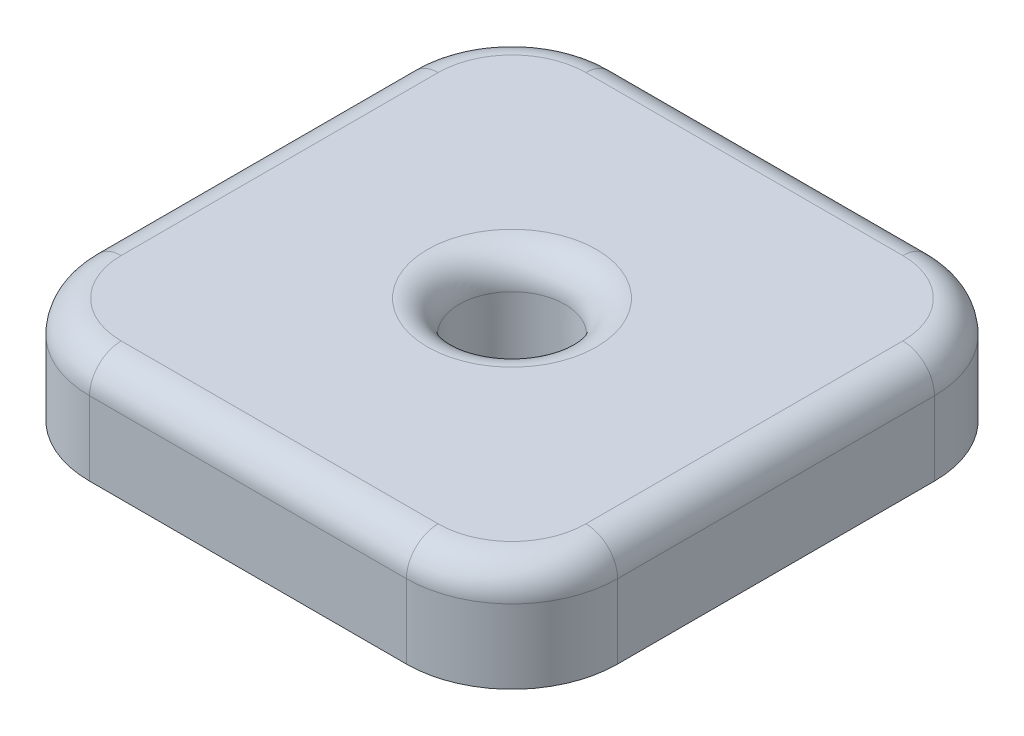
ISO-10303-21;
HEADER;
FILE_DESCRIPTION(('STEP AP214'),'2;1');
FILE_NAME('part.step','',(''),(''),'','','');
FILE_SCHEMA(('AUTOMOTIVE_DESIGN { 1 0 10303 214 1 1 1 1 }'));
ENDSEC;
DATA;
#1=APPLICATION_CONTEXT('core data for automotive mechanical design processes');
#2=APPLICATION_PROTOCOL_DEFINITION('international standard','automotive_design',2000,#1);
#3=PRODUCT_CONTEXT('',#1,'mechanical');
#4=PRODUCT('Part','Part','',(#3));
#5=PRODUCT_RELATED_PRODUCT_CATEGORY('part','',(#4));
#6=PRODUCT_DEFINITION_FORMATION('','',#4);
#7=PRODUCT_DEFINITION_CONTEXT('part definition',#1,'design');
#8=PRODUCT_DEFINITION('design','',#6,#7);
#9=PRODUCT_DEFINITION_SHAPE('','',#8);
#10=(LENGTH_UNIT() NAMED_UNIT(*) SI_UNIT(.MILLI.,.METRE.));
#11=(NAMED_UNIT(*) PLANE_ANGLE_UNIT() SI_UNIT($,.RADIAN.));
#12=(NAMED_UNIT(*) SI_UNIT($,.STERADIAN.) SOLID_ANGLE_UNIT());
#13=UNCERTAINTY_MEASURE_WITH_UNIT(LENGTH_MEASURE(1.E-05),#10,'distance_accuracy_value','');
#14=(GEOMETRIC_REPRESENTATION_CONTEXT(3) GLOBAL_UNCERTAINTY_ASSIGNED_CONTEXT((#13)) GLOBAL_UNIT_ASSIGNED_CONTEXT((#10,
#11,#12)) REPRESENTATION_CONTEXT('',''));
#15=CARTESIAN_POINT('',(0.,0.,0.));
#16=DIRECTION('',(0.,0.,1.));
#17=DIRECTION('',(1.,0.,0.));
#18=AXIS2_PLACEMENT_3D('',#15,#16,#17);
#19=CARTESIAN_POINT('',(25.,10.,25.));
#20=DIRECTION('',(-1.,0.,0.));
#21=DIRECTION('',(0.,0.,1.));
#22=AXIS2_PLACEMENT_3D('',#19,#20,#21);
#23=PLANE('',#22);
#24=DIRECTION('',(0.,-1.,0.));
#25=VECTOR('',#24,1.);
#26=CARTESIAN_POINT('',(25.,10.,-15.));
#27=LINE('',#26,#25);
#28=CARTESIAN_POINT('',(25.,0.,-15.));
#29=VERTEX_POINT('',#28);
#30=CARTESIAN_POINT('',(25.,7.,-15.));
#31=VERTEX_POINT('',#30);
#32=EDGE_CURVE('E170',#29,#31,#27,.F.);
#33=ORIENTED_EDGE('',*,*,#32,.T.);
#34=DIRECTION('',(0.,0.,-1.));
#35=VECTOR('',#34,1.);
#36=CARTESIAN_POINT('',(25.,7.,25.));
#37=LINE('',#36,#35);
#38=CARTESIAN_POINT('',(25.,7.,15.));
#39=VERTEX_POINT('',#38);
#40=EDGE_CURVE('E200',#31,#39,#37,.F.);
#41=ORIENTED_EDGE('',*,*,#40,.T.);
#42=DIRECTION('',(0.,-1.,0.));
#43=VECTOR('',#42,1.);
#44=CARTESIAN_POINT('',(25.,10.,15.));
#45=LINE('',#44,#43);
#46=CARTESIAN_POINT('',(25.,0.,15.));
#47=VERTEX_POINT('',#46);
#48=EDGE_CURVE('E168',#39,#47,#45,.T.);
#49=ORIENTED_EDGE('',*,*,#48,.T.);
#50=DIRECTION('',(0.,0.,-1.));
#51=VECTOR('',#50,1.);
#52=CARTESIAN_POINT('',(25.,0.,25.));
#53=LINE('',#52,#51);
#54=EDGE_CURVE('E234',#47,#29,#53,.T.);
#55=ORIENTED_EDGE('',*,*,#54,.T.);
#56=EDGE_LOOP('',(#33,#41,#49,#55));
#57=FACE_BOUND('',#56,.T.);
#58=ADVANCED_FACE('F37',(#57),#23,.F.);
#59=CARTESIAN_POINT('',(-25.,10.,-25.));
#60=DIRECTION('',(0.,0.,1.));
#61=DIRECTION('',(1.,0.,0.));
#62=AXIS2_PLACEMENT_3D('',#59,#60,#61);
#63=PLANE('',#62);
#64=DIRECTION('',(0.,-1.,0.));
#65=VECTOR('',#64,1.);
#66=CARTESIAN_POINT('',(-15.,10.,-25.));
#67=LINE('',#66,#65);
#68=CARTESIAN_POINT('',(-15.,0.,-25.));
#69=VERTEX_POINT('',#68);
#70=CARTESIAN_POINT('',(-15.,7.,-25.));
#71=VERTEX_POINT('',#70);
#72=EDGE_CURVE('E165',#69,#71,#67,.F.);
#73=ORIENTED_EDGE('',*,*,#72,.T.);
#74=DIRECTION('',(-1.,0.,0.));
#75=VECTOR('',#74,1.);
#76=CARTESIAN_POINT('',(-25.,7.,-25.));
#77=LINE('',#76,#75);
#78=CARTESIAN_POINT('',(15.,7.,-25.));
#79=VERTEX_POINT('',#78);
#80=EDGE_CURVE('E196',#71,#79,#77,.F.);
#81=ORIENTED_EDGE('',*,*,#80,.T.);
#82=DIRECTION('',(0.,-1.,0.));
#83=VECTOR('',#82,1.);
#84=CARTESIAN_POINT('',(15.,10.,-25.));
#85=LINE('',#84,#83);
#86=CARTESIAN_POINT('',(15.,0.,-25.));
#87=VERTEX_POINT('',#86);
#88=EDGE_CURVE('E163',#79,#87,#85,.T.);
#89=ORIENTED_EDGE('',*,*,#88,.T.);
#90=DIRECTION('',(-1.,0.,0.));
#91=VECTOR('',#90,1.);
#92=CARTESIAN_POINT('',(-25.,0.,-25.));
#93=LINE('',#92,#91);
#94=EDGE_CURVE('E153',#87,#69,#93,.T.);
#95=ORIENTED_EDGE('',*,*,#94,.T.);
#96=EDGE_LOOP('',(#73,#81,#89,#95));
#97=FACE_BOUND('',#96,.T.);
#98=ADVANCED_FACE('F244',(#97),#63,.F.);
#99=CARTESIAN_POINT('',(-25.,10.,25.));
#100=DIRECTION('',(1.,0.,0.));
#101=DIRECTION('',(0.,0.,-1.));
#102=AXIS2_PLACEMENT_3D('',#99,#100,#101);
#103=PLANE('',#102);
#104=DIRECTION('',(0.,-1.,0.));
#105=VECTOR('',#104,1.);
#106=CARTESIAN_POINT('',(-25.,10.,15.));
#107=LINE('',#106,#105);
#108=CARTESIAN_POINT('',(-25.,0.,15.));
#109=VERTEX_POINT('',#108);
#110=CARTESIAN_POINT('',(-25.,7.,15.));
#111=VERTEX_POINT('',#110);
#112=EDGE_CURVE('E140',#109,#111,#107,.F.);
#113=ORIENTED_EDGE('',*,*,#112,.T.);
#114=DIRECTION('',(0.,0.,1.));
#115=VECTOR('',#114,1.);
#116=CARTESIAN_POINT('',(-25.,7.,25.));
#117=LINE('',#116,#115);
#118=CARTESIAN_POINT('',(-25.,7.,-15.));
#119=VERTEX_POINT('',#118);
#120=EDGE_CURVE('E46',#111,#119,#117,.F.);
#121=ORIENTED_EDGE('',*,*,#120,.T.);
#122=DIRECTION('',(0.,-1.,0.));
#123=VECTOR('',#122,1.);
#124=CARTESIAN_POINT('',(-25.,10.,-15.));
#125=LINE('',#124,#123);
#126=CARTESIAN_POINT('',(-25.,0.,-15.));
#127=VERTEX_POINT('',#126);
#128=EDGE_CURVE('E144',#119,#127,#125,.T.);
#129=ORIENTED_EDGE('',*,*,#128,.T.);
#130=DIRECTION('',(0.,0.,1.));
#131=VECTOR('',#130,1.);
#132=CARTESIAN_POINT('',(-25.,0.,25.));
#133=LINE('',#132,#131);
#134=EDGE_CURVE('E150',#127,#109,#133,.T.);
#135=ORIENTED_EDGE('',*,*,#134,.T.);
#136=EDGE_LOOP('',(#113,#121,#129,#135));
#137=FACE_BOUND('',#136,.T.);
#138=ADVANCED_FACE('F304',(#137),#103,.F.);
#139=CARTESIAN_POINT('',(-25.,10.,25.));
#140=DIRECTION('',(0.,0.,-1.));
#141=DIRECTION('',(-1.,0.,0.));
#142=AXIS2_PLACEMENT_3D('',#139,#140,#141);
#143=PLANE('',#142);
#144=DIRECTION('',(0.,-1.,0.));
#145=VECTOR('',#144,1.);
#146=CARTESIAN_POINT('',(15.,10.,25.));
#147=LINE('',#146,#145);
#148=CARTESIAN_POINT('',(15.,0.,25.));
#149=VERTEX_POINT('',#148);
#150=CARTESIAN_POINT('',(15.,7.,25.));
#151=VERTEX_POINT('',#150);
#152=EDGE_CURVE('E136',#149,#151,#147,.F.);
#153=ORIENTED_EDGE('',*,*,#152,.T.);
#154=DIRECTION('',(1.,0.,0.));
#155=VECTOR('',#154,1.);
#156=CARTESIAN_POINT('',(-25.,7.,25.));
#157=LINE('',#156,#155);
#158=CARTESIAN_POINT('',(-15.,7.,25.));
#159=VERTEX_POINT('',#158);
#160=EDGE_CURVE('E62',#151,#159,#157,.F.);
#161=ORIENTED_EDGE('',*,*,#160,.T.);
#162=DIRECTION('',(0.,-1.,0.));
#163=VECTOR('',#162,1.);
#164=CARTESIAN_POINT('',(-15.,10.,25.));
#165=LINE('',#164,#163);
#166=CARTESIAN_POINT('',(-15.,0.,25.));
#167=VERTEX_POINT('',#166);
#168=EDGE_CURVE('E128',#159,#167,#165,.T.);
#169=ORIENTED_EDGE('',*,*,#168,.T.);
#170=DIRECTION('',(1.,0.,0.));
#171=VECTOR('',#170,1.);
#172=CARTESIAN_POINT('',(-25.,0.,25.));
#173=LINE('',#172,#171);
#174=EDGE_CURVE('E132',#167,#149,#173,.T.);
#175=ORIENTED_EDGE('',*,*,#174,.T.);
#176=EDGE_LOOP('',(#153,#161,#169,#175));
#177=FACE_BOUND('',#176,.T.);
#178=ADVANCED_FACE('F130',(#177),#143,.F.);
#179=CARTESIAN_POINT('',(0.,10.,0.));
#180=DIRECTION('',(0.,-1.,0.));
#181=DIRECTION('',(0.,0.,-1.));
#182=AXIS2_PLACEMENT_3D('',#179,#180,#181);
#183=PLANE('',#182);
#184=DIRECTION('',(-1.,0.,0.));
#185=VECTOR('',#184,1.);
#186=CARTESIAN_POINT('',(0.,10.,-22.));
#187=LINE('',#186,#185);
#188=CARTESIAN_POINT('',(15.,10.,-22.));
#189=VERTEX_POINT('',#188);
#190=CARTESIAN_POINT('',(-15.,10.,-22.));
#191=VERTEX_POINT('',#190);
#192=EDGE_CURVE('E188',#189,#191,#187,.T.);
#193=ORIENTED_EDGE('',*,*,#192,.T.);
#194=CARTESIAN_POINT('',(-15.,10.,-15.));
#195=DIRECTION('',(0.,-1.,0.));
#196=DIRECTION('',(0.,0.,-1.));
#197=AXIS2_PLACEMENT_3D('',#194,#195,#196);
#198=CIRCLE('',#197,7.);
#199=CARTESIAN_POINT('',(-22.,10.,-15.));
#200=VERTEX_POINT('',#199);
#201=EDGE_CURVE('E190',#191,#200,#198,.F.);
#202=ORIENTED_EDGE('',*,*,#201,.T.);
#203=DIRECTION('',(0.,0.,1.));
#204=VECTOR('',#203,1.);
#205=CARTESIAN_POINT('',(-22.,10.,0.));
#206=LINE('',#205,#204);
#207=CARTESIAN_POINT('',(-22.,10.,15.));
#208=VERTEX_POINT('',#207);
#209=EDGE_CURVE('E176',#200,#208,#206,.T.);
#210=ORIENTED_EDGE('',*,*,#209,.T.);
#211=CARTESIAN_POINT('',(-15.,10.,15.));
#212=DIRECTION('',(0.,-1.,0.));
#213=DIRECTION('',(0.,0.,-1.));
#214=AXIS2_PLACEMENT_3D('',#211,#212,#213);
#215=CIRCLE('',#214,7.);
#216=CARTESIAN_POINT('',(-15.,10.,22.));
#217=VERTEX_POINT('',#216);
#218=EDGE_CURVE('E178',#208,#217,#215,.F.);
#219=ORIENTED_EDGE('',*,*,#218,.T.);
#220=DIRECTION('',(1.,0.,0.));
#221=VECTOR('',#220,1.);
#222=CARTESIAN_POINT('',(0.,10.,22.));
#223=LINE('',#222,#221);
#224=CARTESIAN_POINT('',(15.,10.,22.));
#225=VERTEX_POINT('',#224);
#226=EDGE_CURVE('E180',#217,#225,#223,.T.);
#227=ORIENTED_EDGE('',*,*,#226,.T.);
#228=CARTESIAN_POINT('',(15.,10.,15.));
#229=DIRECTION('',(0.,-1.,0.));
#230=DIRECTION('',(0.,0.,-1.));
#231=AXIS2_PLACEMENT_3D('',#228,#229,#230);
#232=CIRCLE('',#231,7.);
#233=CARTESIAN_POINT('',(22.,10.,15.));
#234=VERTEX_POINT('',#233);
#235=EDGE_CURVE('E182',#225,#234,#232,.F.);
#236=ORIENTED_EDGE('',*,*,#235,.T.);
#237=DIRECTION('',(0.,0.,-1.));
#238=VECTOR('',#237,1.);
#239=CARTESIAN_POINT('',(22.,10.,0.));
#240=LINE('',#239,#238);
#241=CARTESIAN_POINT('',(22.,10.,-15.));
#242=VERTEX_POINT('',#241);
#243=EDGE_CURVE('E184',#234,#242,#240,.T.);
#244=ORIENTED_EDGE('',*,*,#243,.T.);
#245=CARTESIAN_POINT('',(15.,10.,-15.));
#246=DIRECTION('',(0.,-1.,0.));
#247=DIRECTION('',(0.,0.,-1.));
#248=AXIS2_PLACEMENT_3D('',#245,#246,#247);
#249=CIRCLE('',#248,7.);
#250=EDGE_CURVE('E186',#242,#189,#249,.F.);
#251=ORIENTED_EDGE('',*,*,#250,.T.);
#252=EDGE_LOOP('',(#193,#202,#210,#219,#227,#236,#244,#251));
#253=FACE_BOUND('',#252,.T.);
#254=CARTESIAN_POINT('',(0.,10.,0.));
#255=DIRECTION('',(0.,-1.,0.));
#256=DIRECTION('',(0.,0.,-1.));
#257=AXIS2_PLACEMENT_3D('',#254,#255,#256);
#258=CIRCLE('',#257,8.);
#259=CARTESIAN_POINT('',(0.,10.,-8.));
#260=VERTEX_POINT('',#259);
#261=EDGE_CURVE('E173',#260,#260,#258,.T.);
#262=ORIENTED_EDGE('',*,*,#261,.T.);
#263=EDGE_LOOP('',(#262));
#264=FACE_BOUND('',#263,.T.);
#265=ADVANCED_FACE('F265',(#253,#264),#183,.F.);
#266=CARTESIAN_POINT('',(0.,0.,0.));
#267=DIRECTION('',(0.,-1.,0.));
#268=DIRECTION('',(0.,0.,-1.));
#269=AXIS2_PLACEMENT_3D('',#266,#267,#268);
#270=PLANE('',#269);
#271=CARTESIAN_POINT('',(0.,0.,0.));
#272=DIRECTION('',(0.,1.,0.));
#273=DIRECTION('',(0.,0.,1.));
#274=AXIS2_PLACEMENT_3D('',#271,#272,#273);
#275=CIRCLE('',#274,5.);
#276=CARTESIAN_POINT('',(0.,0.,5.));
#277=VERTEX_POINT('',#276);
#278=EDGE_CURVE('E228',#277,#277,#275,.T.);
#279=ORIENTED_EDGE('',*,*,#278,.T.);
#280=EDGE_LOOP('',(#279));
#281=FACE_BOUND('',#280,.T.);
#282=ORIENTED_EDGE('',*,*,#174,.F.);
#283=CARTESIAN_POINT('',(-15.,0.,15.));
#284=DIRECTION('',(0.,-1.,0.));
#285=DIRECTION('',(0.,0.,-1.));
#286=AXIS2_PLACEMENT_3D('',#283,#284,#285);
#287=CIRCLE('',#286,10.);
#288=EDGE_CURVE('E138',#167,#109,#287,.T.);
#289=ORIENTED_EDGE('',*,*,#288,.T.);
#290=ORIENTED_EDGE('',*,*,#134,.F.);
#291=CARTESIAN_POINT('',(-15.,0.,-15.));
#292=DIRECTION('',(0.,-1.,0.));
#293=DIRECTION('',(0.,0.,-1.));
#294=AXIS2_PLACEMENT_3D('',#291,#292,#293);
#295=CIRCLE('',#294,10.);
#296=EDGE_CURVE('E145',#127,#69,#295,.T.);
#297=ORIENTED_EDGE('',*,*,#296,.T.);
#298=ORIENTED_EDGE('',*,*,#94,.F.);
#299=CARTESIAN_POINT('',(15.,0.,-15.));
#300=DIRECTION('',(0.,-1.,0.));
#301=DIRECTION('',(0.,0.,-1.));
#302=AXIS2_PLACEMENT_3D('',#299,#300,#301);
#303=CIRCLE('',#302,10.);
#304=EDGE_CURVE('E158',#87,#29,#303,.T.);
#305=ORIENTED_EDGE('',*,*,#304,.T.);
#306=ORIENTED_EDGE('',*,*,#54,.F.);
#307=CARTESIAN_POINT('',(15.,0.,15.));
#308=DIRECTION('',(0.,-1.,0.));
#309=DIRECTION('',(0.,0.,-1.));
#310=AXIS2_PLACEMENT_3D('',#307,#308,#309);
#311=CIRCLE('',#310,10.);
#312=EDGE_CURVE('E135',#47,#149,#311,.T.);
#313=ORIENTED_EDGE('',*,*,#312,.T.);
#314=EDGE_LOOP('',(#282,#289,#290,#297,#298,#305,#306,#313));
#315=FACE_BOUND('',#314,.T.);
#316=ADVANCED_FACE('F147',(#281,#315),#270,.T.);
#317=CARTESIAN_POINT('',(-15.,10.,15.));
#318=DIRECTION('',(0.,-1.,0.));
#319=DIRECTION('',(0.,0.,-1.));
#320=AXIS2_PLACEMENT_3D('',#317,#318,#319);
#321=CYLINDRICAL_SURFACE('',#320,10.);
#322=ORIENTED_EDGE('',*,*,#168,.F.);
#323=CARTESIAN_POINT('',(-15.,7.,15.));
#324=DIRECTION('',(0.,-1.,0.));
#325=DIRECTION('',(0.,0.,-1.));
#326=AXIS2_PLACEMENT_3D('',#323,#324,#325);
#327=CIRCLE('',#326,10.);
#328=EDGE_CURVE('E54',#159,#111,#327,.T.);
#329=ORIENTED_EDGE('',*,*,#328,.T.);
#330=ORIENTED_EDGE('',*,*,#112,.F.);
#331=ORIENTED_EDGE('',*,*,#288,.F.);
#332=EDGE_LOOP('',(#322,#329,#330,#331));
#333=FACE_BOUND('',#332,.T.);
#334=ADVANCED_FACE('F139',(#333),#321,.T.);
#335=CARTESIAN_POINT('',(-15.,10.,-15.));
#336=DIRECTION('',(0.,-1.,0.));
#337=DIRECTION('',(0.,0.,-1.));
#338=AXIS2_PLACEMENT_3D('',#335,#336,#337);
#339=CYLINDRICAL_SURFACE('',#338,10.);
#340=ORIENTED_EDGE('',*,*,#128,.F.);
#341=CARTESIAN_POINT('',(-15.,7.,-15.));
#342=DIRECTION('',(0.,-1.,0.));
#343=DIRECTION('',(0.,0.,-1.));
#344=AXIS2_PLACEMENT_3D('',#341,#342,#343);
#345=CIRCLE('',#344,10.);
#346=EDGE_CURVE('E193',#119,#71,#345,.T.);
#347=ORIENTED_EDGE('',*,*,#346,.T.);
#348=ORIENTED_EDGE('',*,*,#72,.F.);
#349=ORIENTED_EDGE('',*,*,#296,.F.);
#350=EDGE_LOOP('',(#340,#347,#348,#349));
#351=FACE_BOUND('',#350,.T.);
#352=ADVANCED_FACE('F250',(#351),#339,.T.);
#353=CARTESIAN_POINT('',(15.,10.,-15.));
#354=DIRECTION('',(0.,-1.,0.));
#355=DIRECTION('',(0.,0.,-1.));
#356=AXIS2_PLACEMENT_3D('',#353,#354,#355);
#357=CYLINDRICAL_SURFACE('',#356,10.);
#358=ORIENTED_EDGE('',*,*,#88,.F.);
#359=CARTESIAN_POINT('',(15.,7.,-15.));
#360=DIRECTION('',(0.,-1.,0.));
#361=DIRECTION('',(0.,0.,-1.));
#362=AXIS2_PLACEMENT_3D('',#359,#360,#361);
#363=CIRCLE('',#362,10.);
#364=EDGE_CURVE('E198',#79,#31,#363,.T.);
#365=ORIENTED_EDGE('',*,*,#364,.T.);
#366=ORIENTED_EDGE('',*,*,#32,.F.);
#367=ORIENTED_EDGE('',*,*,#304,.F.);
#368=EDGE_LOOP('',(#358,#365,#366,#367));
#369=FACE_BOUND('',#368,.T.);
#370=ADVANCED_FACE('F274',(#369),#357,.T.);
#371=CARTESIAN_POINT('',(15.,10.,15.));
#372=DIRECTION('',(0.,-1.,0.));
#373=DIRECTION('',(0.,0.,-1.));
#374=AXIS2_PLACEMENT_3D('',#371,#372,#373);
#375=CYLINDRICAL_SURFACE('',#374,10.);
#376=ORIENTED_EDGE('',*,*,#48,.F.);
#377=CARTESIAN_POINT('',(15.,7.,15.));
#378=DIRECTION('',(0.,-1.,0.));
#379=DIRECTION('',(0.,0.,-1.));
#380=AXIS2_PLACEMENT_3D('',#377,#378,#379);
#381=CIRCLE('',#380,10.);
#382=EDGE_CURVE('E202',#39,#151,#381,.T.);
#383=ORIENTED_EDGE('',*,*,#382,.T.);
#384=ORIENTED_EDGE('',*,*,#152,.F.);
#385=ORIENTED_EDGE('',*,*,#312,.F.);
#386=EDGE_LOOP('',(#376,#383,#384,#385));
#387=FACE_BOUND('',#386,.T.);
#388=ADVANCED_FACE('F284',(#387),#375,.T.);
#389=CARTESIAN_POINT('',(0.,0.,0.));
#390=DIRECTION('',(0.,1.,0.));
#391=DIRECTION('',(0.,0.,1.));
#392=AXIS2_PLACEMENT_3D('',#389,#390,#391);
#393=CYLINDRICAL_SURFACE('',#392,5.);
#394=CARTESIAN_POINT('',(0.,7.,0.));
#395=DIRECTION('',(0.,-1.,0.));
#396=DIRECTION('',(0.,0.,-1.));
#397=AXIS2_PLACEMENT_3D('',#394,#395,#396);
#398=CIRCLE('',#397,5.);
#399=CARTESIAN_POINT('',(0.,7.,-5.));
#400=VERTEX_POINT('',#399);
#401=EDGE_CURVE('E11',#400,#400,#398,.F.);
#402=ORIENTED_EDGE('',*,*,#401,.T.);
#403=EDGE_LOOP('',(#402));
#404=FACE_BOUND('',#403,.T.);
#405=ORIENTED_EDGE('',*,*,#278,.F.);
#406=EDGE_LOOP('',(#405));
#407=FACE_BOUND('',#406,.T.);
#408=ADVANCED_FACE('F316',(#404,#407),#393,.F.);
#409=CARTESIAN_POINT('',(15.,7.,15.));
#410=DIRECTION('',(0.,-1.,0.));
#411=DIRECTION('',(0.,0.,-1.));
#412=AXIS2_PLACEMENT_3D('',#409,#410,#411);
#413=TOROIDAL_SURFACE('',#412,7.,3.);
#414=CARTESIAN_POINT('',(15.,7.,22.));
#415=DIRECTION('',(-1.,0.,0.));
#416=DIRECTION('',(0.,0.,1.));
#417=AXIS2_PLACEMENT_3D('',#414,#415,#416);
#418=CIRCLE('',#417,3.);
#419=EDGE_CURVE('E222',#151,#225,#418,.T.);
#420=ORIENTED_EDGE('',*,*,#419,.F.);
#421=ORIENTED_EDGE('',*,*,#382,.F.);
#422=CARTESIAN_POINT('',(22.,7.,15.));
#423=DIRECTION('',(0.,0.,-1.));
#424=DIRECTION('',(-1.,0.,0.));
#425=AXIS2_PLACEMENT_3D('',#422,#423,#424);
#426=CIRCLE('',#425,3.);
#427=EDGE_CURVE('E41',#234,#39,#426,.T.);
#428=ORIENTED_EDGE('',*,*,#427,.F.);
#429=ORIENTED_EDGE('',*,*,#235,.F.);
#430=EDGE_LOOP('',(#420,#421,#428,#429));
#431=FACE_BOUND('',#430,.T.);
#432=ADVANCED_FACE('F286',(#431),#413,.T.);
#433=CARTESIAN_POINT('',(22.,7.,0.));
#434=DIRECTION('',(0.,0.,-1.));
#435=DIRECTION('',(-1.,0.,0.));
#436=AXIS2_PLACEMENT_3D('',#433,#434,#435);
#437=CYLINDRICAL_SURFACE('',#436,3.);
#438=ORIENTED_EDGE('',*,*,#427,.T.);
#439=ORIENTED_EDGE('',*,*,#40,.F.);
#440=CARTESIAN_POINT('',(22.,7.,-15.));
#441=DIRECTION('',(0.,0.,-1.));
#442=DIRECTION('',(-1.,0.,0.));
#443=AXIS2_PLACEMENT_3D('',#440,#441,#442);
#444=CIRCLE('',#443,3.);
#445=EDGE_CURVE('E220',#242,#31,#444,.T.);
#446=ORIENTED_EDGE('',*,*,#445,.F.);
#447=ORIENTED_EDGE('',*,*,#243,.F.);
#448=EDGE_LOOP('',(#438,#439,#446,#447));
#449=FACE_BOUND('',#448,.T.);
#450=ADVANCED_FACE('F279',(#449),#437,.T.);
#451=CARTESIAN_POINT('',(0.,7.,22.));
#452=DIRECTION('',(1.,0.,0.));
#453=DIRECTION('',(0.,0.,-1.));
#454=AXIS2_PLACEMENT_3D('',#451,#452,#453);
#455=CYLINDRICAL_SURFACE('',#454,3.);
#456=ORIENTED_EDGE('',*,*,#419,.T.);
#457=ORIENTED_EDGE('',*,*,#226,.F.);
#458=CARTESIAN_POINT('',(-15.,7.,22.));
#459=DIRECTION('',(-1.,0.,0.));
#460=DIRECTION('',(0.,0.,1.));
#461=AXIS2_PLACEMENT_3D('',#458,#459,#460);
#462=CIRCLE('',#461,3.);
#463=EDGE_CURVE('E217',#159,#217,#462,.T.);
#464=ORIENTED_EDGE('',*,*,#463,.F.);
#465=ORIENTED_EDGE('',*,*,#160,.F.);
#466=EDGE_LOOP('',(#456,#457,#464,#465));
#467=FACE_BOUND('',#466,.T.);
#468=ADVANCED_FACE('F288',(#467),#455,.T.);
#469=CARTESIAN_POINT('',(15.,7.,-15.));
#470=DIRECTION('',(0.,-1.,0.));
#471=DIRECTION('',(0.,0.,-1.));
#472=AXIS2_PLACEMENT_3D('',#469,#470,#471);
#473=TOROIDAL_SURFACE('',#472,7.,3.);
#474=ORIENTED_EDGE('',*,*,#445,.T.);
#475=ORIENTED_EDGE('',*,*,#364,.F.);
#476=CARTESIAN_POINT('',(15.,7.,-22.));
#477=DIRECTION('',(-1.,0.,0.));
#478=DIRECTION('',(0.,0.,1.));
#479=AXIS2_PLACEMENT_3D('',#476,#477,#478);
#480=CIRCLE('',#479,3.);
#481=EDGE_CURVE('E214',#189,#79,#480,.T.);
#482=ORIENTED_EDGE('',*,*,#481,.F.);
#483=ORIENTED_EDGE('',*,*,#250,.F.);
#484=EDGE_LOOP('',(#474,#475,#482,#483));
#485=FACE_BOUND('',#484,.T.);
#486=ADVANCED_FACE('F277',(#485),#473,.T.);
#487=CARTESIAN_POINT('',(-15.,7.,15.));
#488=DIRECTION('',(0.,-1.,0.));
#489=DIRECTION('',(0.,0.,-1.));
#490=AXIS2_PLACEMENT_3D('',#487,#488,#489);
#491=TOROIDAL_SURFACE('',#490,7.,3.);
#492=ORIENTED_EDGE('',*,*,#463,.T.);
#493=ORIENTED_EDGE('',*,*,#218,.F.);
#494=CARTESIAN_POINT('',(-22.,7.,15.));
#495=DIRECTION('',(0.,0.,-1.));
#496=DIRECTION('',(-1.,0.,0.));
#497=AXIS2_PLACEMENT_3D('',#494,#495,#496);
#498=CIRCLE('',#497,3.);
#499=EDGE_CURVE('E211',#111,#208,#498,.T.);
#500=ORIENTED_EDGE('',*,*,#499,.F.);
#501=ORIENTED_EDGE('',*,*,#328,.F.);
#502=EDGE_LOOP('',(#492,#493,#500,#501));
#503=FACE_BOUND('',#502,.T.);
#504=ADVANCED_FACE('F290',(#503),#491,.T.);
#505=CARTESIAN_POINT('',(0.,7.,-22.));
#506=DIRECTION('',(-1.,0.,0.));
#507=DIRECTION('',(0.,0.,1.));
#508=AXIS2_PLACEMENT_3D('',#505,#506,#507);
#509=CYLINDRICAL_SURFACE('',#508,3.);
#510=ORIENTED_EDGE('',*,*,#481,.T.);
#511=ORIENTED_EDGE('',*,*,#80,.F.);
#512=CARTESIAN_POINT('',(-15.,7.,-22.));
#513=DIRECTION('',(-1.,0.,0.));
#514=DIRECTION('',(0.,0.,1.));
#515=AXIS2_PLACEMENT_3D('',#512,#513,#514);
#516=CIRCLE('',#515,3.);
#517=EDGE_CURVE('E209',#191,#71,#516,.T.);
#518=ORIENTED_EDGE('',*,*,#517,.F.);
#519=ORIENTED_EDGE('',*,*,#192,.F.);
#520=EDGE_LOOP('',(#510,#511,#518,#519));
#521=FACE_BOUND('',#520,.T.);
#522=ADVANCED_FACE('F271',(#521),#509,.T.);
#523=CARTESIAN_POINT('',(-22.,7.,0.));
#524=DIRECTION('',(0.,0.,1.));
#525=DIRECTION('',(1.,0.,0.));
#526=AXIS2_PLACEMENT_3D('',#523,#524,#525);
#527=CYLINDRICAL_SURFACE('',#526,3.);
#528=ORIENTED_EDGE('',*,*,#499,.T.);
#529=ORIENTED_EDGE('',*,*,#209,.F.);
#530=CARTESIAN_POINT('',(-22.,7.,-15.));
#531=DIRECTION('',(0.,0.,-1.));
#532=DIRECTION('',(-1.,0.,0.));
#533=AXIS2_PLACEMENT_3D('',#530,#531,#532);
#534=CIRCLE('',#533,3.);
#535=EDGE_CURVE('E207',#119,#200,#534,.T.);
#536=ORIENTED_EDGE('',*,*,#535,.F.);
#537=ORIENTED_EDGE('',*,*,#120,.F.);
#538=EDGE_LOOP('',(#528,#529,#536,#537));
#539=FACE_BOUND('',#538,.T.);
#540=ADVANCED_FACE('F261',(#539),#527,.T.);
#541=CARTESIAN_POINT('',(-15.,7.,-15.));
#542=DIRECTION('',(0.,-1.,0.));
#543=DIRECTION('',(0.,0.,-1.));
#544=AXIS2_PLACEMENT_3D('',#541,#542,#543);
#545=TOROIDAL_SURFACE('',#544,7.,3.);
#546=ORIENTED_EDGE('',*,*,#517,.T.);
#547=ORIENTED_EDGE('',*,*,#346,.F.);
#548=ORIENTED_EDGE('',*,*,#535,.T.);
#549=ORIENTED_EDGE('',*,*,#201,.F.);
#550=EDGE_LOOP('',(#546,#547,#548,#549));
#551=FACE_BOUND('',#550,.T.);
#552=ADVANCED_FACE('F254',(#551),#545,.T.);
#553=CARTESIAN_POINT('',(0.,7.,0.));
#554=DIRECTION('',(0.,-1.,0.));
#555=DIRECTION('',(0.,0.,-1.));
#556=AXIS2_PLACEMENT_3D('',#553,#554,#555);
#557=TOROIDAL_SURFACE('',#556,8.,3.);
#558=ORIENTED_EDGE('',*,*,#261,.F.);
#559=EDGE_LOOP('',(#558));
#560=FACE_BOUND('',#559,.T.);
#561=ORIENTED_EDGE('',*,*,#401,.F.);
#562=EDGE_LOOP('',(#561));
#563=FACE_BOUND('',#562,.T.);
#564=ADVANCED_FACE('F39',(#560,#563),#557,.T.);
#565=CLOSED_SHELL('',(#58,#98,#138,#178,#265,#316,#334,#352,#370,#388,#408,#432,#450,#468,#486,
#504,#522,#540,#552,#564));
#566=MANIFOLD_SOLID_BREP('B2',#565);
#567=ADVANCED_BREP_SHAPE_REPRESENTATION('',(#18,#566),#14);
#568=SHAPE_DEFINITION_REPRESENTATION(#9,#567);
ENDSEC;
END-ISO-10303-21;
